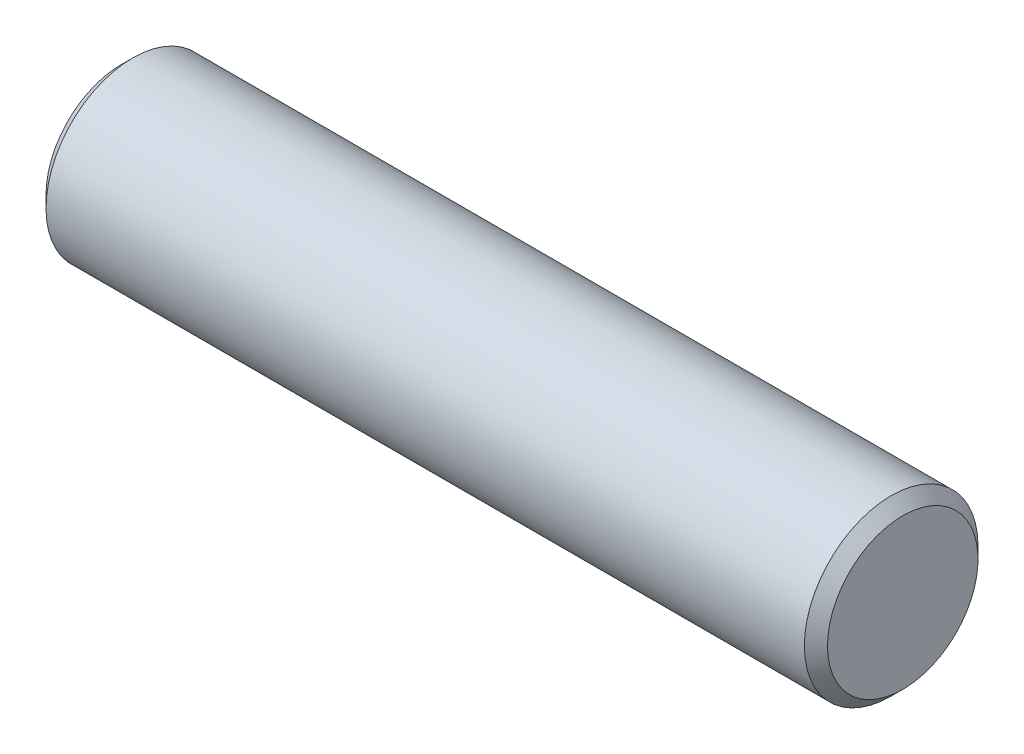
ISO-10303-21;
HEADER;
FILE_DESCRIPTION(('STEP AP214'),'2;1');
FILE_NAME('part.step','',(''),(''),'','','');
FILE_SCHEMA(('AUTOMOTIVE_DESIGN { 1 0 10303 214 1 1 1 1 }'));
ENDSEC;
DATA;
#1=APPLICATION_CONTEXT('core data for automotive mechanical design processes');
#2=APPLICATION_PROTOCOL_DEFINITION('international standard','automotive_design',2000,#1);
#3=PRODUCT_CONTEXT('',#1,'mechanical');
#4=PRODUCT('Part','Part','',(#3));
#5=PRODUCT_RELATED_PRODUCT_CATEGORY('part','',(#4));
#6=PRODUCT_DEFINITION_FORMATION('','',#4);
#7=PRODUCT_DEFINITION_CONTEXT('part definition',#1,'design');
#8=PRODUCT_DEFINITION('design','',#6,#7);
#9=PRODUCT_DEFINITION_SHAPE('','',#8);
#10=(LENGTH_UNIT() NAMED_UNIT(*) SI_UNIT(.MILLI.,.METRE.));
#11=(NAMED_UNIT(*) PLANE_ANGLE_UNIT() SI_UNIT($,.RADIAN.));
#12=(NAMED_UNIT(*) SI_UNIT($,.STERADIAN.) SOLID_ANGLE_UNIT());
#13=UNCERTAINTY_MEASURE_WITH_UNIT(LENGTH_MEASURE(1.E-05),#10,'distance_accuracy_value','');
#14=(GEOMETRIC_REPRESENTATION_CONTEXT(3) GLOBAL_UNCERTAINTY_ASSIGNED_CONTEXT((#13)) GLOBAL_UNIT_ASSIGNED_CONTEXT((#10,
#11,#12)) REPRESENTATION_CONTEXT('',''));
#15=CARTESIAN_POINT('',(0.,0.,0.));
#16=DIRECTION('',(0.,0.,1.));
#17=DIRECTION('',(1.,0.,0.));
#18=AXIS2_PLACEMENT_3D('',#15,#16,#17);
#19=CARTESIAN_POINT('',(0.,0.,0.));
#20=DIRECTION('',(1.,0.,0.));
#21=DIRECTION('',(0.,0.,-1.));
#22=AXIS2_PLACEMENT_3D('',#19,#20,#21);
#23=PLANE('',#22);
#24=CARTESIAN_POINT('',(0.,0.,0.));
#25=DIRECTION('',(-1.,0.,0.));
#26=DIRECTION('',(0.,0.,1.));
#27=AXIS2_PLACEMENT_3D('',#24,#25,#26);
#28=CIRCLE('',#27,1.3);
#29=CARTESIAN_POINT('',(0.,0.,1.3));
#30=VERTEX_POINT('',#29);
#31=EDGE_CURVE('E10',#30,#30,#28,.T.);
#32=ORIENTED_EDGE('',*,*,#31,.T.);
#33=EDGE_LOOP('',(#32));
#34=FACE_BOUND('',#33,.T.);
#35=ADVANCED_FACE('F37',(#34),#23,.F.);
#36=CARTESIAN_POINT('',(0.2,0.,0.));
#37=DIRECTION('',(1.,0.,0.));
#38=DIRECTION('',(0.,0.,-1.));
#39=AXIS2_PLACEMENT_3D('',#36,#37,#38);
#40=CONICAL_SURFACE('',#39,1.5,0.785398163397445);
#41=ORIENTED_EDGE('',*,*,#31,.F.);
#42=EDGE_LOOP('',(#41));
#43=FACE_BOUND('',#42,.T.);
#44=CARTESIAN_POINT('',(0.2,0.,0.));
#45=DIRECTION('',(-1.,0.,0.));
#46=DIRECTION('',(0.,0.,1.));
#47=AXIS2_PLACEMENT_3D('',#44,#45,#46);
#48=CIRCLE('',#47,1.5);
#49=CARTESIAN_POINT('',(0.2,0.,1.5));
#50=VERTEX_POINT('',#49);
#51=EDGE_CURVE('E43',#50,#50,#48,.T.);
#52=ORIENTED_EDGE('',*,*,#51,.T.);
#53=EDGE_LOOP('',(#52));
#54=FACE_BOUND('',#53,.T.);
#55=ADVANCED_FACE('F69',(#43,#54),#40,.T.);
#56=CARTESIAN_POINT('',(0.,0.,0.));
#57=DIRECTION('',(-1.,0.,0.));
#58=DIRECTION('',(0.,0.,1.));
#59=AXIS2_PLACEMENT_3D('',#56,#57,#58);
#60=CYLINDRICAL_SURFACE('',#59,1.5);
#61=ORIENTED_EDGE('',*,*,#51,.F.);
#62=EDGE_LOOP('',(#61));
#63=FACE_BOUND('',#62,.T.);
#64=CARTESIAN_POINT('',(13.3,0.,0.));
#65=DIRECTION('',(-1.,0.,0.));
#66=DIRECTION('',(0.,0.,1.));
#67=AXIS2_PLACEMENT_3D('',#64,#65,#66);
#68=CIRCLE('',#67,1.5);
#69=CARTESIAN_POINT('',(13.3,0.,1.5));
#70=VERTEX_POINT('',#69);
#71=EDGE_CURVE('E47',#70,#70,#68,.T.);
#72=ORIENTED_EDGE('',*,*,#71,.T.);
#73=EDGE_LOOP('',(#72));
#74=FACE_BOUND('',#73,.T.);
#75=ADVANCED_FACE('F65',(#63,#74),#60,.T.);
#76=CARTESIAN_POINT('',(13.5,0.,0.));
#77=DIRECTION('',(-1.,0.,0.));
#78=DIRECTION('',(0.,0.,1.));
#79=AXIS2_PLACEMENT_3D('',#76,#77,#78);
#80=CONICAL_SURFACE('',#79,1.3,0.785398163397437);
#81=ORIENTED_EDGE('',*,*,#71,.F.);
#82=EDGE_LOOP('',(#81));
#83=FACE_BOUND('',#82,.T.);
#84=CARTESIAN_POINT('',(13.5,0.,0.));
#85=DIRECTION('',(-1.,0.,0.));
#86=DIRECTION('',(0.,0.,1.));
#87=AXIS2_PLACEMENT_3D('',#84,#85,#86);
#88=CIRCLE('',#87,1.3);
#89=CARTESIAN_POINT('',(13.5,0.,1.3));
#90=VERTEX_POINT('',#89);
#91=EDGE_CURVE('E51',#90,#90,#88,.T.);
#92=ORIENTED_EDGE('',*,*,#91,.T.);
#93=EDGE_LOOP('',(#92));
#94=FACE_BOUND('',#93,.T.);
#95=ADVANCED_FACE('F57',(#83,#94),#80,.T.);
#96=CARTESIAN_POINT('',(13.5,1.3,0.));
#97=DIRECTION('',(-1.,0.,0.));
#98=DIRECTION('',(0.,0.,1.));
#99=AXIS2_PLACEMENT_3D('',#96,#97,#98);
#100=PLANE('',#99);
#101=ORIENTED_EDGE('',*,*,#91,.F.);
#102=EDGE_LOOP('',(#101));
#103=FACE_BOUND('',#102,.T.);
#104=ADVANCED_FACE('F59',(#103),#100,.F.);
#105=CLOSED_SHELL('',(#35,#55,#75,#95,#104));
#106=MANIFOLD_SOLID_BREP('B2',#105);
#107=ADVANCED_BREP_SHAPE_REPRESENTATION('',(#18,#106),#14);
#108=SHAPE_DEFINITION_REPRESENTATION(#9,#107);
ENDSEC;
END-ISO-10303-21;
